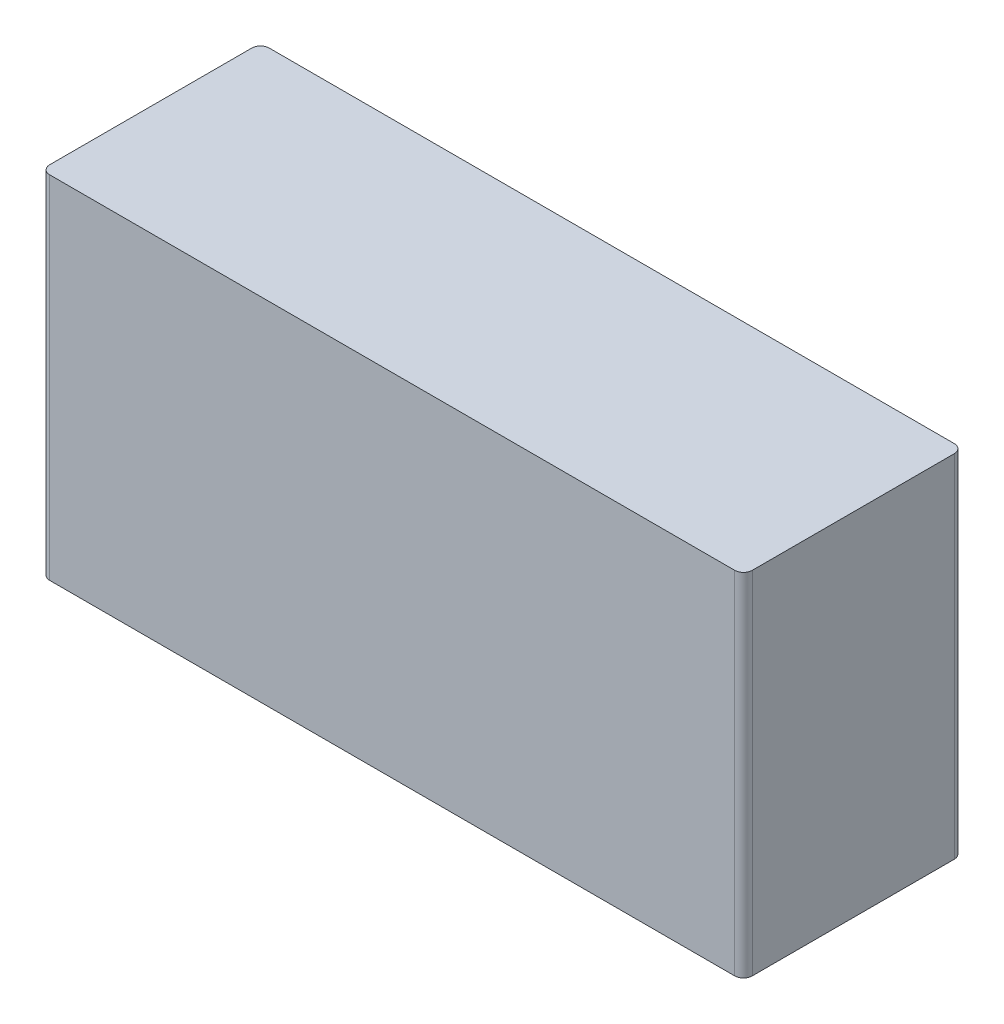
ISO-10303-21;
HEADER;
FILE_DESCRIPTION(('STEP AP214'),'2;1');
FILE_NAME('part.step','',(''),(''),'','','');
FILE_SCHEMA(('AUTOMOTIVE_DESIGN { 1 0 10303 214 1 1 1 1 }'));
ENDSEC;
DATA;
#1=APPLICATION_CONTEXT('core data for automotive mechanical design processes');
#2=APPLICATION_PROTOCOL_DEFINITION('international standard','automotive_design',2000,#1);
#3=PRODUCT_CONTEXT('',#1,'mechanical');
#4=PRODUCT('Part','Part','',(#3));
#5=PRODUCT_RELATED_PRODUCT_CATEGORY('part','',(#4));
#6=PRODUCT_DEFINITION_FORMATION('','',#4);
#7=PRODUCT_DEFINITION_CONTEXT('part definition',#1,'design');
#8=PRODUCT_DEFINITION('design','',#6,#7);
#9=PRODUCT_DEFINITION_SHAPE('','',#8);
#10=(LENGTH_UNIT() NAMED_UNIT(*) SI_UNIT(.MILLI.,.METRE.));
#11=(NAMED_UNIT(*) PLANE_ANGLE_UNIT() SI_UNIT($,.RADIAN.));
#12=(NAMED_UNIT(*) SI_UNIT($,.STERADIAN.) SOLID_ANGLE_UNIT());
#13=UNCERTAINTY_MEASURE_WITH_UNIT(LENGTH_MEASURE(1.E-05),#10,'distance_accuracy_value','');
#14=(GEOMETRIC_REPRESENTATION_CONTEXT(3) GLOBAL_UNCERTAINTY_ASSIGNED_CONTEXT((#13)) GLOBAL_UNIT_ASSIGNED_CONTEXT((#10,
#11,#12)) REPRESENTATION_CONTEXT('',''));
#15=CARTESIAN_POINT('',(0.,0.,0.));
#16=DIRECTION('',(0.,0.,1.));
#17=DIRECTION('',(1.,0.,0.));
#18=AXIS2_PLACEMENT_3D('',#15,#16,#17);
#19=CARTESIAN_POINT('',(0.,0.,25.));
#20=DIRECTION('',(1.,0.,0.));
#21=DIRECTION('',(0.,0.,-1.));
#22=AXIS2_PLACEMENT_3D('',#19,#20,#21);
#23=PLANE('',#22);
#24=DIRECTION('',(0.,0.,-1.));
#25=VECTOR('',#24,1.);
#26=CARTESIAN_POINT('',(0.,40.,25.));
#27=LINE('',#26,#25);
#28=CARTESIAN_POINT('',(0.,40.,24.));
#29=VERTEX_POINT('',#28);
#30=CARTESIAN_POINT('',(0.,40.,1.));
#31=VERTEX_POINT('',#30);
#32=EDGE_CURVE('E138',#29,#31,#27,.T.);
#33=ORIENTED_EDGE('',*,*,#32,.T.);
#34=DIRECTION('',(0.,-1.,0.));
#35=VECTOR('',#34,1.);
#36=CARTESIAN_POINT('',(0.,0.,1.));
#37=LINE('',#36,#35);
#38=CARTESIAN_POINT('',(0.,0.,1.));
#39=VERTEX_POINT('',#38);
#40=EDGE_CURVE('E164',#31,#39,#37,.T.);
#41=ORIENTED_EDGE('',*,*,#40,.T.);
#42=DIRECTION('',(0.,0.,-1.));
#43=VECTOR('',#42,1.);
#44=CARTESIAN_POINT('',(0.,0.,25.));
#45=LINE('',#44,#43);
#46=CARTESIAN_POINT('',(0.,0.,24.));
#47=VERTEX_POINT('',#46);
#48=EDGE_CURVE('E127',#47,#39,#45,.T.);
#49=ORIENTED_EDGE('',*,*,#48,.F.);
#50=DIRECTION('',(0.,-1.,0.));
#51=VECTOR('',#50,1.);
#52=CARTESIAN_POINT('',(0.,0.,24.));
#53=LINE('',#52,#51);
#54=EDGE_CURVE('E112',#47,#29,#53,.F.);
#55=ORIENTED_EDGE('',*,*,#54,.T.);
#56=EDGE_LOOP('',(#33,#41,#49,#55));
#57=FACE_BOUND('',#56,.T.);
#58=ADVANCED_FACE('F39',(#57),#23,.F.);
#59=CARTESIAN_POINT('',(0.,0.,25.));
#60=DIRECTION('',(0.,1.,0.));
#61=DIRECTION('',(0.,0.,1.));
#62=AXIS2_PLACEMENT_3D('',#59,#60,#61);
#63=PLANE('',#62);
#64=ORIENTED_EDGE('',*,*,#48,.T.);
#65=CARTESIAN_POINT('',(1.,0.,1.));
#66=DIRECTION('',(0.,1.,0.));
#67=DIRECTION('',(0.,0.,1.));
#68=AXIS2_PLACEMENT_3D('',#65,#66,#67);
#69=CIRCLE('',#68,1.);
#70=CARTESIAN_POINT('',(1.,0.,0.));
#71=VERTEX_POINT('',#70);
#72=EDGE_CURVE('E173',#39,#71,#69,.F.);
#73=ORIENTED_EDGE('',*,*,#72,.T.);
#74=DIRECTION('',(1.,0.,0.));
#75=VECTOR('',#74,1.);
#76=CARTESIAN_POINT('',(0.,0.,0.));
#77=LINE('',#76,#75);
#78=CARTESIAN_POINT('',(79.,0.,0.));
#79=VERTEX_POINT('',#78);
#80=EDGE_CURVE('E141',#71,#79,#77,.T.);
#81=ORIENTED_EDGE('',*,*,#80,.T.);
#82=CARTESIAN_POINT('',(79.,0.,1.));
#83=DIRECTION('',(0.,1.,0.));
#84=DIRECTION('',(0.,0.,1.));
#85=AXIS2_PLACEMENT_3D('',#82,#83,#84);
#86=CIRCLE('',#85,1.);
#87=CARTESIAN_POINT('',(80.,0.,1.));
#88=VERTEX_POINT('',#87);
#89=EDGE_CURVE('E170',#79,#88,#86,.F.);
#90=ORIENTED_EDGE('',*,*,#89,.T.);
#91=DIRECTION('',(0.,0.,-1.));
#92=VECTOR('',#91,1.);
#93=CARTESIAN_POINT('',(80.,0.,25.));
#94=LINE('',#93,#92);
#95=CARTESIAN_POINT('',(80.,0.,24.));
#96=VERTEX_POINT('',#95);
#97=EDGE_CURVE('E153',#96,#88,#94,.T.);
#98=ORIENTED_EDGE('',*,*,#97,.F.);
#99=CARTESIAN_POINT('',(79.,0.,24.));
#100=DIRECTION('',(0.,1.,0.));
#101=DIRECTION('',(0.,0.,1.));
#102=AXIS2_PLACEMENT_3D('',#99,#100,#101);
#103=CIRCLE('',#102,1.);
#104=CARTESIAN_POINT('',(79.,0.,25.));
#105=VERTEX_POINT('',#104);
#106=EDGE_CURVE('E132',#96,#105,#103,.F.);
#107=ORIENTED_EDGE('',*,*,#106,.T.);
#108=DIRECTION('',(1.,0.,0.));
#109=VECTOR('',#108,1.);
#110=CARTESIAN_POINT('',(0.,0.,25.));
#111=LINE('',#110,#109);
#112=CARTESIAN_POINT('',(1.,0.,25.));
#113=VERTEX_POINT('',#112);
#114=EDGE_CURVE('E122',#113,#105,#111,.T.);
#115=ORIENTED_EDGE('',*,*,#114,.F.);
#116=CARTESIAN_POINT('',(1.,0.,24.));
#117=DIRECTION('',(0.,1.,0.));
#118=DIRECTION('',(0.,0.,1.));
#119=AXIS2_PLACEMENT_3D('',#116,#117,#118);
#120=CIRCLE('',#119,1.);
#121=EDGE_CURVE('E107',#113,#47,#120,.F.);
#122=ORIENTED_EDGE('',*,*,#121,.T.);
#123=EDGE_LOOP('',(#64,#73,#81,#90,#98,#107,#115,#122));
#124=FACE_BOUND('',#123,.T.);
#125=ADVANCED_FACE('F129',(#124),#63,.F.);
#126=CARTESIAN_POINT('',(80.,0.,25.));
#127=DIRECTION('',(-1.,0.,0.));
#128=DIRECTION('',(0.,-1.,0.));
#129=AXIS2_PLACEMENT_3D('',#126,#127,#128);
#130=PLANE('',#129);
#131=ORIENTED_EDGE('',*,*,#97,.T.);
#132=DIRECTION('',(0.,1.,0.));
#133=VECTOR('',#132,1.);
#134=CARTESIAN_POINT('',(80.,40.,1.));
#135=LINE('',#134,#133);
#136=CARTESIAN_POINT('',(80.,40.,1.));
#137=VERTEX_POINT('',#136);
#138=EDGE_CURVE('E48',#88,#137,#135,.T.);
#139=ORIENTED_EDGE('',*,*,#138,.T.);
#140=DIRECTION('',(0.,0.,-1.));
#141=VECTOR('',#140,1.);
#142=CARTESIAN_POINT('',(80.,40.,25.));
#143=LINE('',#142,#141);
#144=CARTESIAN_POINT('',(80.,40.,24.));
#145=VERTEX_POINT('',#144);
#146=EDGE_CURVE('E150',#145,#137,#143,.T.);
#147=ORIENTED_EDGE('',*,*,#146,.F.);
#148=DIRECTION('',(0.,1.,0.));
#149=VECTOR('',#148,1.);
#150=CARTESIAN_POINT('',(80.,0.,24.));
#151=LINE('',#150,#149);
#152=EDGE_CURVE('E189',#145,#96,#151,.F.);
#153=ORIENTED_EDGE('',*,*,#152,.T.);
#154=EDGE_LOOP('',(#131,#139,#147,#153));
#155=FACE_BOUND('',#154,.T.);
#156=ADVANCED_FACE('F193',(#155),#130,.F.);
#157=CARTESIAN_POINT('',(0.,40.,25.));
#158=DIRECTION('',(0.,-1.,0.));
#159=DIRECTION('',(0.,0.,-1.));
#160=AXIS2_PLACEMENT_3D('',#157,#158,#159);
#161=PLANE('',#160);
#162=DIRECTION('',(-1.,0.,0.));
#163=VECTOR('',#162,1.);
#164=CARTESIAN_POINT('',(0.,40.,0.));
#165=LINE('',#164,#163);
#166=CARTESIAN_POINT('',(79.,40.,0.));
#167=VERTEX_POINT('',#166);
#168=CARTESIAN_POINT('',(1.,40.,0.));
#169=VERTEX_POINT('',#168);
#170=EDGE_CURVE('E134',#167,#169,#165,.T.);
#171=ORIENTED_EDGE('',*,*,#170,.T.);
#172=CARTESIAN_POINT('',(1.,40.,1.));
#173=DIRECTION('',(0.,-1.,0.));
#174=DIRECTION('',(0.,0.,-1.));
#175=AXIS2_PLACEMENT_3D('',#172,#173,#174);
#176=CIRCLE('',#175,1.);
#177=EDGE_CURVE('E186',#169,#31,#176,.F.);
#178=ORIENTED_EDGE('',*,*,#177,.T.);
#179=ORIENTED_EDGE('',*,*,#32,.F.);
#180=CARTESIAN_POINT('',(1.,40.,24.));
#181=DIRECTION('',(0.,-1.,0.));
#182=DIRECTION('',(0.,0.,-1.));
#183=AXIS2_PLACEMENT_3D('',#180,#181,#182);
#184=CIRCLE('',#183,1.);
#185=CARTESIAN_POINT('',(1.,40.,25.));
#186=VERTEX_POINT('',#185);
#187=EDGE_CURVE('E161',#29,#186,#184,.F.);
#188=ORIENTED_EDGE('',*,*,#187,.T.);
#189=DIRECTION('',(-1.,0.,0.));
#190=VECTOR('',#189,1.);
#191=CARTESIAN_POINT('',(0.,40.,25.));
#192=LINE('',#191,#190);
#193=CARTESIAN_POINT('',(79.,40.,25.));
#194=VERTEX_POINT('',#193);
#195=EDGE_CURVE('E124',#194,#186,#192,.T.);
#196=ORIENTED_EDGE('',*,*,#195,.F.);
#197=CARTESIAN_POINT('',(79.,40.,24.));
#198=DIRECTION('',(0.,-1.,0.));
#199=DIRECTION('',(0.,0.,-1.));
#200=AXIS2_PLACEMENT_3D('',#197,#198,#199);
#201=CIRCLE('',#200,1.);
#202=EDGE_CURVE('E63',#194,#145,#201,.F.);
#203=ORIENTED_EDGE('',*,*,#202,.T.);
#204=ORIENTED_EDGE('',*,*,#146,.T.);
#205=CARTESIAN_POINT('',(79.,40.,1.));
#206=DIRECTION('',(0.,-1.,0.));
#207=DIRECTION('',(0.,0.,-1.));
#208=AXIS2_PLACEMENT_3D('',#205,#206,#207);
#209=CIRCLE('',#208,1.);
#210=EDGE_CURVE('E55',#137,#167,#209,.F.);
#211=ORIENTED_EDGE('',*,*,#210,.T.);
#212=EDGE_LOOP('',(#171,#178,#179,#188,#196,#203,#204,#211));
#213=FACE_BOUND('',#212,.T.);
#214=ADVANCED_FACE('F196',(#213),#161,.F.);
#215=CARTESIAN_POINT('',(0.,0.,25.));
#216=DIRECTION('',(0.,0.,-1.));
#217=DIRECTION('',(-1.,0.,0.));
#218=AXIS2_PLACEMENT_3D('',#215,#216,#217);
#219=PLANE('',#218);
#220=ORIENTED_EDGE('',*,*,#114,.T.);
#221=DIRECTION('',(0.,1.,0.));
#222=VECTOR('',#221,1.);
#223=CARTESIAN_POINT('',(79.,0.,25.));
#224=LINE('',#223,#222);
#225=EDGE_CURVE('E11',#105,#194,#224,.T.);
#226=ORIENTED_EDGE('',*,*,#225,.T.);
#227=ORIENTED_EDGE('',*,*,#195,.T.);
#228=DIRECTION('',(0.,-1.,0.));
#229=VECTOR('',#228,1.);
#230=CARTESIAN_POINT('',(1.,0.,25.));
#231=LINE('',#230,#229);
#232=EDGE_CURVE('E111',#186,#113,#231,.T.);
#233=ORIENTED_EDGE('',*,*,#232,.T.);
#234=EDGE_LOOP('',(#220,#226,#227,#233));
#235=FACE_BOUND('',#234,.T.);
#236=ADVANCED_FACE('F121',(#235),#219,.F.);
#237=CARTESIAN_POINT('',(0.,0.,0.));
#238=DIRECTION('',(0.,0.,-1.));
#239=DIRECTION('',(-1.,0.,0.));
#240=AXIS2_PLACEMENT_3D('',#237,#238,#239);
#241=PLANE('',#240);
#242=ORIENTED_EDGE('',*,*,#80,.F.);
#243=DIRECTION('',(0.,-1.,0.));
#244=VECTOR('',#243,1.);
#245=CARTESIAN_POINT('',(1.,40.,0.));
#246=LINE('',#245,#244);
#247=EDGE_CURVE('E179',#71,#169,#246,.F.);
#248=ORIENTED_EDGE('',*,*,#247,.T.);
#249=ORIENTED_EDGE('',*,*,#170,.F.);
#250=DIRECTION('',(0.,1.,0.));
#251=VECTOR('',#250,1.);
#252=CARTESIAN_POINT('',(79.,0.,0.));
#253=LINE('',#252,#251);
#254=EDGE_CURVE('E176',#167,#79,#253,.F.);
#255=ORIENTED_EDGE('',*,*,#254,.T.);
#256=EDGE_LOOP('',(#242,#248,#249,#255));
#257=FACE_BOUND('',#256,.T.);
#258=ADVANCED_FACE('F201',(#257),#241,.T.);
#259=CARTESIAN_POINT('',(1.,0.,24.));
#260=DIRECTION('',(0.,-1.,0.));
#261=DIRECTION('',(0.,0.,-1.));
#262=AXIS2_PLACEMENT_3D('',#259,#260,#261);
#263=CYLINDRICAL_SURFACE('',#262,1.);
#264=ORIENTED_EDGE('',*,*,#187,.F.);
#265=ORIENTED_EDGE('',*,*,#54,.F.);
#266=ORIENTED_EDGE('',*,*,#121,.F.);
#267=ORIENTED_EDGE('',*,*,#232,.F.);
#268=EDGE_LOOP('',(#264,#265,#266,#267));
#269=FACE_BOUND('',#268,.T.);
#270=ADVANCED_FACE('F110',(#269),#263,.T.);
#271=CARTESIAN_POINT('',(1.,0.,1.));
#272=DIRECTION('',(0.,1.,0.));
#273=DIRECTION('',(0.,0.,1.));
#274=AXIS2_PLACEMENT_3D('',#271,#272,#273);
#275=CYLINDRICAL_SURFACE('',#274,1.);
#276=ORIENTED_EDGE('',*,*,#177,.F.);
#277=ORIENTED_EDGE('',*,*,#247,.F.);
#278=ORIENTED_EDGE('',*,*,#72,.F.);
#279=ORIENTED_EDGE('',*,*,#40,.F.);
#280=EDGE_LOOP('',(#276,#277,#278,#279));
#281=FACE_BOUND('',#280,.T.);
#282=ADVANCED_FACE('F205',(#281),#275,.T.);
#283=CARTESIAN_POINT('',(79.,0.,1.));
#284=DIRECTION('',(0.,-1.,0.));
#285=DIRECTION('',(1.,0.,0.));
#286=AXIS2_PLACEMENT_3D('',#283,#284,#285);
#287=CYLINDRICAL_SURFACE('',#286,1.);
#288=ORIENTED_EDGE('',*,*,#89,.F.);
#289=ORIENTED_EDGE('',*,*,#254,.F.);
#290=ORIENTED_EDGE('',*,*,#210,.F.);
#291=ORIENTED_EDGE('',*,*,#138,.F.);
#292=EDGE_LOOP('',(#288,#289,#290,#291));
#293=FACE_BOUND('',#292,.T.);
#294=ADVANCED_FACE('F203',(#293),#287,.T.);
#295=CARTESIAN_POINT('',(79.,0.,24.));
#296=DIRECTION('',(0.,1.,0.));
#297=DIRECTION('',(-1.,0.,0.));
#298=AXIS2_PLACEMENT_3D('',#295,#296,#297);
#299=CYLINDRICAL_SURFACE('',#298,1.);
#300=ORIENTED_EDGE('',*,*,#106,.F.);
#301=ORIENTED_EDGE('',*,*,#152,.F.);
#302=ORIENTED_EDGE('',*,*,#202,.F.);
#303=ORIENTED_EDGE('',*,*,#225,.F.);
#304=EDGE_LOOP('',(#300,#301,#302,#303));
#305=FACE_BOUND('',#304,.T.);
#306=ADVANCED_FACE('F41',(#305),#299,.T.);
#307=CLOSED_SHELL('',(#58,#125,#156,#214,#236,#258,#270,#282,#294,#306));
#308=MANIFOLD_SOLID_BREP('B2',#307);
#309=ADVANCED_BREP_SHAPE_REPRESENTATION('',(#18,#308),#14);
#310=SHAPE_DEFINITION_REPRESENTATION(#9,#309);
ENDSEC;
END-ISO-10303-21;
